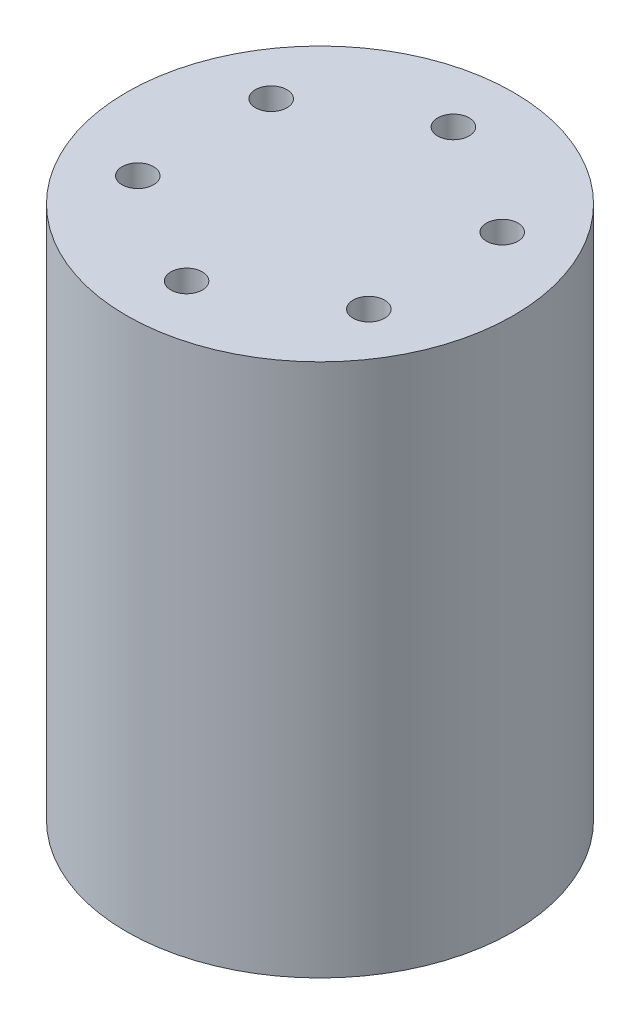
ISO-10303-21;
HEADER;
FILE_DESCRIPTION(('STEP AP214'),'2;1');
FILE_NAME('part.step','',(''),(''),'','','');
FILE_SCHEMA(('AUTOMOTIVE_DESIGN { 1 0 10303 214 1 1 1 1 }'));
ENDSEC;
DATA;
#1=APPLICATION_CONTEXT('core data for automotive mechanical design processes');
#2=APPLICATION_PROTOCOL_DEFINITION('international standard','automotive_design',2000,#1);
#3=PRODUCT_CONTEXT('',#1,'mechanical');
#4=PRODUCT('Part','Part','',(#3));
#5=PRODUCT_RELATED_PRODUCT_CATEGORY('part','',(#4));
#6=PRODUCT_DEFINITION_FORMATION('','',#4);
#7=PRODUCT_DEFINITION_CONTEXT('part definition',#1,'design');
#8=PRODUCT_DEFINITION('design','',#6,#7);
#9=PRODUCT_DEFINITION_SHAPE('','',#8);
#10=(LENGTH_UNIT() NAMED_UNIT(*) SI_UNIT(.MILLI.,.METRE.));
#11=(NAMED_UNIT(*) PLANE_ANGLE_UNIT() SI_UNIT($,.RADIAN.));
#12=(NAMED_UNIT(*) SI_UNIT($,.STERADIAN.) SOLID_ANGLE_UNIT());
#13=UNCERTAINTY_MEASURE_WITH_UNIT(LENGTH_MEASURE(1.E-05),#10,'distance_accuracy_value','');
#14=(GEOMETRIC_REPRESENTATION_CONTEXT(3) GLOBAL_UNCERTAINTY_ASSIGNED_CONTEXT((#13)) GLOBAL_UNIT_ASSIGNED_CONTEXT((#10,
#11,#12)) REPRESENTATION_CONTEXT('',''));
#15=CARTESIAN_POINT('',(0.,0.,0.));
#16=DIRECTION('',(0.,0.,1.));
#17=DIRECTION('',(1.,0.,0.));
#18=AXIS2_PLACEMENT_3D('',#15,#16,#17);
#19=CARTESIAN_POINT('',(0.,25.4,0.));
#20=DIRECTION('',(0.,-1.,0.));
#21=DIRECTION('',(0.,0.,-1.));
#22=AXIS2_PLACEMENT_3D('',#19,#20,#21);
#23=CYLINDRICAL_SURFACE('',#22,18.415);
#24=CARTESIAN_POINT('',(0.,25.4,0.));
#25=DIRECTION('',(0.,1.,0.));
#26=DIRECTION('',(0.,0.,1.));
#27=AXIS2_PLACEMENT_3D('',#24,#25,#26);
#28=CIRCLE('',#27,18.415);
#29=CARTESIAN_POINT('',(0.,25.4,18.415));
#30=VERTEX_POINT('',#29);
#31=EDGE_CURVE('E10',#30,#30,#28,.T.);
#32=ORIENTED_EDGE('',*,*,#31,.F.);
#33=EDGE_LOOP('',(#32));
#34=FACE_BOUND('',#33,.T.);
#35=CARTESIAN_POINT('',(0.,-25.4,0.));
#36=DIRECTION('',(0.,1.,0.));
#37=DIRECTION('',(0.,0.,1.));
#38=AXIS2_PLACEMENT_3D('',#35,#36,#37);
#39=CIRCLE('',#38,18.415);
#40=CARTESIAN_POINT('',(0.,-25.4,18.415));
#41=VERTEX_POINT('',#40);
#42=EDGE_CURVE('E36',#41,#41,#39,.T.);
#43=ORIENTED_EDGE('',*,*,#42,.T.);
#44=EDGE_LOOP('',(#43));
#45=FACE_BOUND('',#44,.T.);
#46=ADVANCED_FACE('F33',(#34,#45),#23,.T.);
#47=CARTESIAN_POINT('',(0.,25.4,0.));
#48=DIRECTION('',(0.,1.,0.));
#49=DIRECTION('',(0.,0.,1.));
#50=AXIS2_PLACEMENT_3D('',#47,#48,#49);
#51=PLANE('',#50);
#52=CARTESIAN_POINT('',(10.9985226280623,25.4,-6.35000000000013));
#53=DIRECTION('',(0.,1.,0.));
#54=DIRECTION('',(-0.866025403784433,0.,0.50000000000001));
#55=AXIS2_PLACEMENT_3D('',#52,#53,#54);
#56=CIRCLE('',#55,1.5);
#57=CARTESIAN_POINT('',(9.69948452238565,25.4,-5.60000000000011));
#58=VERTEX_POINT('',#57);
#59=EDGE_CURVE('E57',#58,#58,#56,.T.);
#60=ORIENTED_EDGE('',*,*,#59,.F.);
#61=EDGE_LOOP('',(#60));
#62=FACE_BOUND('',#61,.T.);
#63=CARTESIAN_POINT('',(10.9985226280624,25.4,6.3499999999999));
#64=DIRECTION('',(0.,1.,0.));
#65=DIRECTION('',(-0.866025403784443,0.,-0.499999999999992));
#66=AXIS2_PLACEMENT_3D('',#63,#64,#65);
#67=CIRCLE('',#66,1.5);
#68=CARTESIAN_POINT('',(9.69948452238576,25.4,5.59999999999991));
#69=VERTEX_POINT('',#68);
#70=EDGE_CURVE('E63',#69,#69,#67,.T.);
#71=ORIENTED_EDGE('',*,*,#70,.F.);
#72=EDGE_LOOP('',(#71));
#73=FACE_BOUND('',#72,.T.);
#74=CARTESIAN_POINT('',(0.,25.4,12.7));
#75=DIRECTION('',(0.,1.,0.));
#76=DIRECTION('',(0.,0.,-1.));
#77=AXIS2_PLACEMENT_3D('',#74,#75,#76);
#78=CIRCLE('',#77,1.5);
#79=CARTESIAN_POINT('',(0.,25.4,11.2));
#80=VERTEX_POINT('',#79);
#81=EDGE_CURVE('E69',#80,#80,#78,.T.);
#82=ORIENTED_EDGE('',*,*,#81,.F.);
#83=EDGE_LOOP('',(#82));
#84=FACE_BOUND('',#83,.T.);
#85=CARTESIAN_POINT('',(-10.9985226280623,25.4,6.35000000000005));
#86=DIRECTION('',(0.,1.,0.));
#87=DIRECTION('',(0.866025403784436,0.,-0.500000000000004));
#88=AXIS2_PLACEMENT_3D('',#85,#86,#87);
#89=CIRCLE('',#88,1.5);
#90=CARTESIAN_POINT('',(-9.69948452238569,25.4,5.60000000000005));
#91=VERTEX_POINT('',#90);
#92=EDGE_CURVE('E75',#91,#91,#89,.T.);
#93=ORIENTED_EDGE('',*,*,#92,.F.);
#94=EDGE_LOOP('',(#93));
#95=FACE_BOUND('',#94,.T.);
#96=CARTESIAN_POINT('',(-10.9985226280624,25.4,-6.34999999999997));
#97=DIRECTION('',(0.,1.,0.));
#98=DIRECTION('',(0.86602540378444,0.,0.499999999999998));
#99=AXIS2_PLACEMENT_3D('',#96,#97,#98);
#100=CIRCLE('',#99,1.5);
#101=CARTESIAN_POINT('',(-9.69948452238573,25.4,-5.59999999999998));
#102=VERTEX_POINT('',#101);
#103=EDGE_CURVE('E51',#102,#102,#100,.T.);
#104=ORIENTED_EDGE('',*,*,#103,.F.);
#105=EDGE_LOOP('',(#104));
#106=FACE_BOUND('',#105,.T.);
#107=CARTESIAN_POINT('',(0.,25.4,-12.7));
#108=DIRECTION('',(0.,1.,0.));
#109=DIRECTION('',(0.,0.,1.));
#110=AXIS2_PLACEMENT_3D('',#107,#108,#109);
#111=CIRCLE('',#110,1.5);
#112=CARTESIAN_POINT('',(0.,25.4,-11.2));
#113=VERTEX_POINT('',#112);
#114=EDGE_CURVE('E45',#113,#113,#111,.T.);
#115=ORIENTED_EDGE('',*,*,#114,.F.);
#116=EDGE_LOOP('',(#115));
#117=FACE_BOUND('',#116,.T.);
#118=ORIENTED_EDGE('',*,*,#31,.T.);
#119=EDGE_LOOP('',(#118));
#120=FACE_BOUND('',#119,.T.);
#121=ADVANCED_FACE('F90',(#62,#73,#84,#95,#106,#117,#120),#51,.T.);
#122=CARTESIAN_POINT('',(0.,-25.4,0.));
#123=DIRECTION('',(0.,1.,0.));
#124=DIRECTION('',(0.,0.,1.));
#125=AXIS2_PLACEMENT_3D('',#122,#123,#124);
#126=PLANE('',#125);
#127=ORIENTED_EDGE('',*,*,#42,.F.);
#128=EDGE_LOOP('',(#127));
#129=FACE_BOUND('',#128,.T.);
#130=ADVANCED_FACE('F93',(#129),#126,.F.);
#131=CARTESIAN_POINT('',(0.,12.7,-12.7));
#132=DIRECTION('',(0.,1.,0.));
#133=DIRECTION('',(0.,0.,1.));
#134=AXIS2_PLACEMENT_3D('',#131,#132,#133);
#135=CYLINDRICAL_SURFACE('',#134,1.5);
#136=CARTESIAN_POINT('',(0.,12.7,-12.7));
#137=DIRECTION('',(0.,1.,0.));
#138=DIRECTION('',(0.,0.,1.));
#139=AXIS2_PLACEMENT_3D('',#136,#137,#138);
#140=CIRCLE('',#139,1.5);
#141=CARTESIAN_POINT('',(0.,12.7,-11.2));
#142=VERTEX_POINT('',#141);
#143=EDGE_CURVE('E43',#142,#142,#140,.T.);
#144=ORIENTED_EDGE('',*,*,#143,.F.);
#145=EDGE_LOOP('',(#144));
#146=FACE_BOUND('',#145,.T.);
#147=ORIENTED_EDGE('',*,*,#114,.T.);
#148=EDGE_LOOP('',(#147));
#149=FACE_BOUND('',#148,.T.);
#150=ADVANCED_FACE('F100',(#146,#149),#135,.F.);
#151=CARTESIAN_POINT('',(0.,12.7,-12.7));
#152=DIRECTION('',(0.,1.,0.));
#153=DIRECTION('',(0.,0.,1.));
#154=AXIS2_PLACEMENT_3D('',#151,#152,#153);
#155=PLANE('',#154);
#156=ORIENTED_EDGE('',*,*,#143,.T.);
#157=EDGE_LOOP('',(#156));
#158=FACE_BOUND('',#157,.T.);
#159=ADVANCED_FACE('F102',(#158),#155,.T.);
#160=CARTESIAN_POINT('',(-10.9985226280624,12.7,-6.34999999999997));
#161=DIRECTION('',(0.,1.,0.));
#162=DIRECTION('',(0.,0.,1.));
#163=AXIS2_PLACEMENT_3D('',#160,#161,#162);
#164=CYLINDRICAL_SURFACE('',#163,1.5);
#165=CARTESIAN_POINT('',(-10.9985226280624,12.7,-6.34999999999997));
#166=DIRECTION('',(0.,1.,0.));
#167=DIRECTION('',(0.86602540378444,0.,0.499999999999998));
#168=AXIS2_PLACEMENT_3D('',#165,#166,#167);
#169=CIRCLE('',#168,1.5);
#170=CARTESIAN_POINT('',(-9.69948452238573,12.7,-5.59999999999998));
#171=VERTEX_POINT('',#170);
#172=EDGE_CURVE('E48',#171,#171,#169,.T.);
#173=ORIENTED_EDGE('',*,*,#172,.F.);
#174=EDGE_LOOP('',(#173));
#175=FACE_BOUND('',#174,.T.);
#176=ORIENTED_EDGE('',*,*,#103,.T.);
#177=EDGE_LOOP('',(#176));
#178=FACE_BOUND('',#177,.T.);
#179=ADVANCED_FACE('F109',(#175,#178),#164,.F.);
#180=CARTESIAN_POINT('',(-10.9985226280624,12.7,-6.34999999999997));
#181=DIRECTION('',(0.,1.,0.));
#182=DIRECTION('',(0.86602540378444,0.,0.499999999999998));
#183=AXIS2_PLACEMENT_3D('',#180,#181,#182);
#184=PLANE('',#183);
#185=ORIENTED_EDGE('',*,*,#172,.T.);
#186=EDGE_LOOP('',(#185));
#187=FACE_BOUND('',#186,.T.);
#188=ADVANCED_FACE('F86',(#187),#184,.T.);
#189=CARTESIAN_POINT('',(-10.9985226280623,12.7,6.35000000000005));
#190=DIRECTION('',(0.,1.,0.));
#191=DIRECTION('',(0.,0.,1.));
#192=AXIS2_PLACEMENT_3D('',#189,#190,#191);
#193=CYLINDRICAL_SURFACE('',#192,1.5);
#194=CARTESIAN_POINT('',(-10.9985226280623,12.7,6.35000000000005));
#195=DIRECTION('',(0.,1.,0.));
#196=DIRECTION('',(0.866025403784436,0.,-0.500000000000004));
#197=AXIS2_PLACEMENT_3D('',#194,#195,#196);
#198=CIRCLE('',#197,1.5);
#199=CARTESIAN_POINT('',(-9.69948452238569,12.7,5.60000000000005));
#200=VERTEX_POINT('',#199);
#201=EDGE_CURVE('E54',#200,#200,#198,.T.);
#202=ORIENTED_EDGE('',*,*,#201,.F.);
#203=EDGE_LOOP('',(#202));
#204=FACE_BOUND('',#203,.T.);
#205=ORIENTED_EDGE('',*,*,#92,.T.);
#206=EDGE_LOOP('',(#205));
#207=FACE_BOUND('',#206,.T.);
#208=ADVANCED_FACE('F83',(#204,#207),#193,.F.);
#209=CARTESIAN_POINT('',(-10.9985226280623,12.7,6.35000000000005));
#210=DIRECTION('',(0.,1.,0.));
#211=DIRECTION('',(0.866025403784436,0.,-0.500000000000004));
#212=AXIS2_PLACEMENT_3D('',#209,#210,#211);
#213=PLANE('',#212);
#214=ORIENTED_EDGE('',*,*,#201,.T.);
#215=EDGE_LOOP('',(#214));
#216=FACE_BOUND('',#215,.T.);
#217=ADVANCED_FACE('F81',(#216),#213,.T.);
#218=CARTESIAN_POINT('',(0.,12.7,12.7));
#219=DIRECTION('',(0.,1.,0.));
#220=DIRECTION('',(0.,0.,1.));
#221=AXIS2_PLACEMENT_3D('',#218,#219,#220);
#222=CYLINDRICAL_SURFACE('',#221,1.5);
#223=CARTESIAN_POINT('',(0.,12.7,12.7));
#224=DIRECTION('',(0.,1.,0.));
#225=DIRECTION('',(0.,0.,-1.));
#226=AXIS2_PLACEMENT_3D('',#223,#224,#225);
#227=CIRCLE('',#226,1.5);
#228=CARTESIAN_POINT('',(0.,12.7,11.2));
#229=VERTEX_POINT('',#228);
#230=EDGE_CURVE('E72',#229,#229,#227,.T.);
#231=ORIENTED_EDGE('',*,*,#230,.F.);
#232=EDGE_LOOP('',(#231));
#233=FACE_BOUND('',#232,.T.);
#234=ORIENTED_EDGE('',*,*,#81,.T.);
#235=EDGE_LOOP('',(#234));
#236=FACE_BOUND('',#235,.T.);
#237=ADVANCED_FACE('F164',(#233,#236),#222,.F.);
#238=CARTESIAN_POINT('',(0.,12.7,12.7));
#239=DIRECTION('',(0.,1.,0.));
#240=DIRECTION('',(0.,0.,-1.));
#241=AXIS2_PLACEMENT_3D('',#238,#239,#240);
#242=PLANE('',#241);
#243=ORIENTED_EDGE('',*,*,#230,.T.);
#244=EDGE_LOOP('',(#243));
#245=FACE_BOUND('',#244,.T.);
#246=ADVANCED_FACE('F171',(#245),#242,.T.);
#247=CARTESIAN_POINT('',(10.9985226280624,12.7,6.3499999999999));
#248=DIRECTION('',(0.,1.,0.));
#249=DIRECTION('',(0.,0.,1.));
#250=AXIS2_PLACEMENT_3D('',#247,#248,#249);
#251=CYLINDRICAL_SURFACE('',#250,1.5);
#252=CARTESIAN_POINT('',(10.9985226280624,12.7,6.3499999999999));
#253=DIRECTION('',(0.,1.,0.));
#254=DIRECTION('',(-0.866025403784443,0.,-0.499999999999992));
#255=AXIS2_PLACEMENT_3D('',#252,#253,#254);
#256=CIRCLE('',#255,1.5);
#257=CARTESIAN_POINT('',(9.69948452238576,12.7,5.59999999999991));
#258=VERTEX_POINT('',#257);
#259=EDGE_CURVE('E66',#258,#258,#256,.T.);
#260=ORIENTED_EDGE('',*,*,#259,.F.);
#261=EDGE_LOOP('',(#260));
#262=FACE_BOUND('',#261,.T.);
#263=ORIENTED_EDGE('',*,*,#70,.T.);
#264=EDGE_LOOP('',(#263));
#265=FACE_BOUND('',#264,.T.);
#266=ADVANCED_FACE('F179',(#262,#265),#251,.F.);
#267=CARTESIAN_POINT('',(10.9985226280624,12.7,6.3499999999999));
#268=DIRECTION('',(0.,1.,0.));
#269=DIRECTION('',(-0.866025403784443,0.,-0.499999999999992));
#270=AXIS2_PLACEMENT_3D('',#267,#268,#269);
#271=PLANE('',#270);
#272=ORIENTED_EDGE('',*,*,#259,.T.);
#273=EDGE_LOOP('',(#272));
#274=FACE_BOUND('',#273,.T.);
#275=ADVANCED_FACE('F187',(#274),#271,.T.);
#276=CARTESIAN_POINT('',(10.9985226280623,12.7,-6.35000000000013));
#277=DIRECTION('',(0.,1.,0.));
#278=DIRECTION('',(0.,0.,1.));
#279=AXIS2_PLACEMENT_3D('',#276,#277,#278);
#280=CYLINDRICAL_SURFACE('',#279,1.5);
#281=CARTESIAN_POINT('',(10.9985226280623,12.7,-6.35000000000013));
#282=DIRECTION('',(0.,1.,0.));
#283=DIRECTION('',(-0.866025403784433,0.,0.50000000000001));
#284=AXIS2_PLACEMENT_3D('',#281,#282,#283);
#285=CIRCLE('',#284,1.5);
#286=CARTESIAN_POINT('',(9.69948452238565,12.7,-5.60000000000011));
#287=VERTEX_POINT('',#286);
#288=EDGE_CURVE('E60',#287,#287,#285,.T.);
#289=ORIENTED_EDGE('',*,*,#288,.F.);
#290=EDGE_LOOP('',(#289));
#291=FACE_BOUND('',#290,.T.);
#292=ORIENTED_EDGE('',*,*,#59,.T.);
#293=EDGE_LOOP('',(#292));
#294=FACE_BOUND('',#293,.T.);
#295=ADVANCED_FACE('F195',(#291,#294),#280,.F.);
#296=CARTESIAN_POINT('',(10.9985226280623,12.7,-6.35000000000013));
#297=DIRECTION('',(0.,1.,0.));
#298=DIRECTION('',(-0.866025403784433,0.,0.50000000000001));
#299=AXIS2_PLACEMENT_3D('',#296,#297,#298);
#300=PLANE('',#299);
#301=ORIENTED_EDGE('',*,*,#288,.T.);
#302=EDGE_LOOP('',(#301));
#303=FACE_BOUND('',#302,.T.);
#304=ADVANCED_FACE('F203',(#303),#300,.T.);
#305=CLOSED_SHELL('',(#46,#121,#130,#150,#159,#179,#188,#208,#217,#237,#246,#266,#275,#295,#304));
#306=MANIFOLD_SOLID_BREP('B2',#305);
#307=ADVANCED_BREP_SHAPE_REPRESENTATION('',(#18,#306),#14);
#308=SHAPE_DEFINITION_REPRESENTATION(#9,#307);
ENDSEC;
END-ISO-10303-21;
